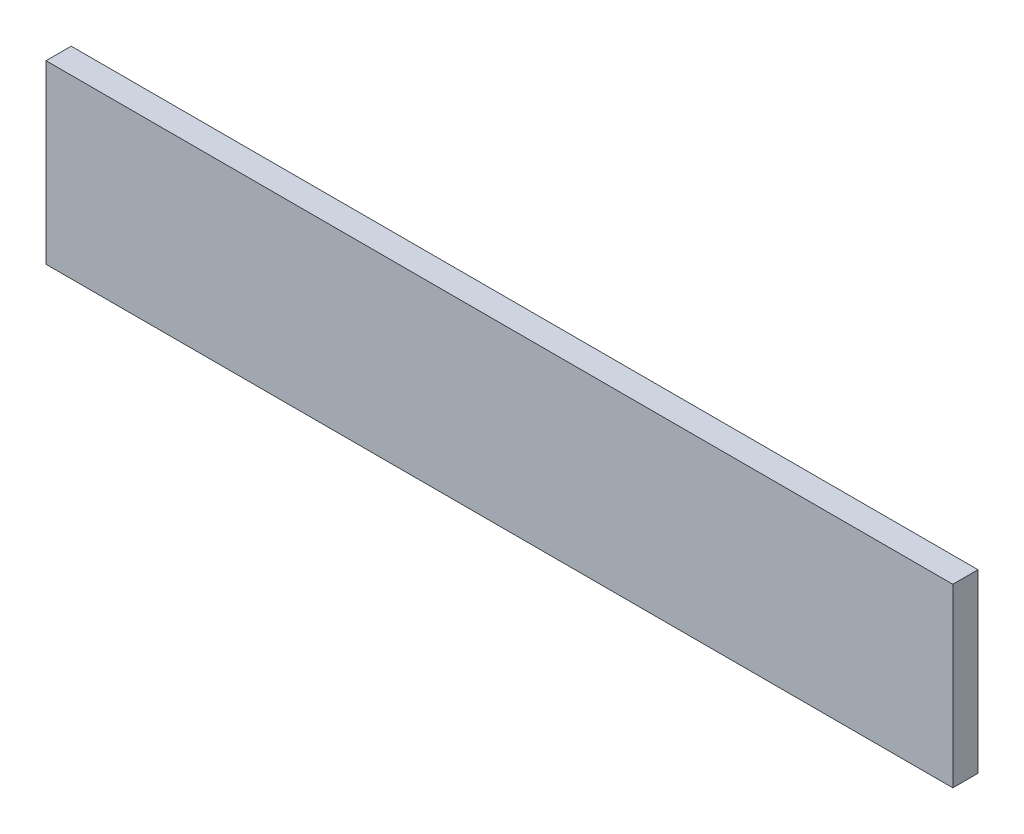
ISO-10303-21;
HEADER;
FILE_DESCRIPTION(('STEP AP214'),'2;1');
FILE_NAME('part.step','',(''),(''),'','','');
FILE_SCHEMA(('AUTOMOTIVE_DESIGN { 1 0 10303 214 1 1 1 1 }'));
ENDSEC;
DATA;
#1=APPLICATION_CONTEXT('core data for automotive mechanical design processes');
#2=APPLICATION_PROTOCOL_DEFINITION('international standard','automotive_design',2000,#1);
#3=PRODUCT_CONTEXT('',#1,'mechanical');
#4=PRODUCT('Part','Part','',(#3));
#5=PRODUCT_RELATED_PRODUCT_CATEGORY('part','',(#4));
#6=PRODUCT_DEFINITION_FORMATION('','',#4);
#7=PRODUCT_DEFINITION_CONTEXT('part definition',#1,'design');
#8=PRODUCT_DEFINITION('design','',#6,#7);
#9=PRODUCT_DEFINITION_SHAPE('','',#8);
#10=(LENGTH_UNIT() NAMED_UNIT(*) SI_UNIT(.MILLI.,.METRE.));
#11=(NAMED_UNIT(*) PLANE_ANGLE_UNIT() SI_UNIT($,.RADIAN.));
#12=(NAMED_UNIT(*) SI_UNIT($,.STERADIAN.) SOLID_ANGLE_UNIT());
#13=UNCERTAINTY_MEASURE_WITH_UNIT(LENGTH_MEASURE(1.E-05),#10,'distance_accuracy_value','');
#14=(GEOMETRIC_REPRESENTATION_CONTEXT(3) GLOBAL_UNCERTAINTY_ASSIGNED_CONTEXT((#13)) GLOBAL_UNIT_ASSIGNED_CONTEXT((#10,
#11,#12)) REPRESENTATION_CONTEXT('',''));
#15=CARTESIAN_POINT('',(0.,0.,0.));
#16=DIRECTION('',(0.,0.,1.));
#17=DIRECTION('',(1.,0.,0.));
#18=AXIS2_PLACEMENT_3D('',#15,#16,#17);
#19=CARTESIAN_POINT('',(0.,0.,5.));
#20=DIRECTION('',(1.,0.,0.));
#21=DIRECTION('',(0.,0.,-0.999999999999995));
#22=AXIS2_PLACEMENT_3D('',#19,#20,#21);
#23=PLANE('',#22);
#24=DIRECTION('',(0.,-1.,0.));
#25=VECTOR('',#24,1.);
#26=CARTESIAN_POINT('',(0.,0.,0.));
#27=LINE('',#26,#25);
#28=CARTESIAN_POINT('',(0.,35.,0.));
#29=VERTEX_POINT('',#28);
#30=CARTESIAN_POINT('',(0.,0.,0.));
#31=VERTEX_POINT('',#30);
#32=EDGE_CURVE('E96',#29,#31,#27,.T.);
#33=ORIENTED_EDGE('',*,*,#32,.T.);
#34=DIRECTION('',(0.,0.,-0.999999999999995));
#35=VECTOR('',#34,1.);
#36=CARTESIAN_POINT('',(0.,0.,5.));
#37=LINE('',#36,#35);
#38=CARTESIAN_POINT('',(0.,0.,5.));
#39=VERTEX_POINT('',#38);
#40=EDGE_CURVE('E11',#39,#31,#37,.T.);
#41=ORIENTED_EDGE('',*,*,#40,.F.);
#42=DIRECTION('',(0.,-1.,0.));
#43=VECTOR('',#42,1.);
#44=CARTESIAN_POINT('',(0.,0.,5.));
#45=LINE('',#44,#43);
#46=CARTESIAN_POINT('',(0.,35.,5.));
#47=VERTEX_POINT('',#46);
#48=EDGE_CURVE('E84',#47,#39,#45,.T.);
#49=ORIENTED_EDGE('',*,*,#48,.F.);
#50=DIRECTION('',(0.,0.,-0.999999999999995));
#51=VECTOR('',#50,1.);
#52=CARTESIAN_POINT('',(0.,35.,5.));
#53=LINE('',#52,#51);
#54=EDGE_CURVE('E92',#47,#29,#53,.T.);
#55=ORIENTED_EDGE('',*,*,#54,.T.);
#56=EDGE_LOOP('',(#33,#41,#49,#55));
#57=FACE_BOUND('',#56,.T.);
#58=ADVANCED_FACE('F33',(#57),#23,.F.);
#59=CARTESIAN_POINT('',(0.,0.,5.));
#60=DIRECTION('',(0.,1.,0.));
#61=DIRECTION('',(0.,0.,0.999999999999995));
#62=AXIS2_PLACEMENT_3D('',#59,#60,#61);
#63=PLANE('',#62);
#64=DIRECTION('',(1.,0.,0.));
#65=VECTOR('',#64,1.);
#66=CARTESIAN_POINT('',(0.,0.,0.));
#67=LINE('',#66,#65);
#68=CARTESIAN_POINT('',(180.,0.,0.));
#69=VERTEX_POINT('',#68);
#70=EDGE_CURVE('E88',#31,#69,#67,.T.);
#71=ORIENTED_EDGE('',*,*,#70,.T.);
#72=DIRECTION('',(0.,0.,-0.999999999999995));
#73=VECTOR('',#72,1.);
#74=CARTESIAN_POINT('',(180.,0.,5.));
#75=LINE('',#74,#73);
#76=CARTESIAN_POINT('',(180.,0.,5.));
#77=VERTEX_POINT('',#76);
#78=EDGE_CURVE('E41',#77,#69,#75,.T.);
#79=ORIENTED_EDGE('',*,*,#78,.F.);
#80=DIRECTION('',(1.,0.,0.));
#81=VECTOR('',#80,1.);
#82=CARTESIAN_POINT('',(0.,0.,5.));
#83=LINE('',#82,#81);
#84=EDGE_CURVE('E79',#39,#77,#83,.T.);
#85=ORIENTED_EDGE('',*,*,#84,.F.);
#86=ORIENTED_EDGE('',*,*,#40,.T.);
#87=EDGE_LOOP('',(#71,#79,#85,#86));
#88=FACE_BOUND('',#87,.T.);
#89=ADVANCED_FACE('F87',(#88),#63,.F.);
#90=CARTESIAN_POINT('',(180.,0.,5.));
#91=DIRECTION('',(-1.,0.,0.));
#92=DIRECTION('',(0.,0.,0.999999999999995));
#93=AXIS2_PLACEMENT_3D('',#90,#91,#92);
#94=PLANE('',#93);
#95=DIRECTION('',(0.,1.,0.));
#96=VECTOR('',#95,1.);
#97=CARTESIAN_POINT('',(180.,0.,0.));
#98=LINE('',#97,#96);
#99=CARTESIAN_POINT('',(180.,35.,0.));
#100=VERTEX_POINT('',#99);
#101=EDGE_CURVE('E66',#69,#100,#98,.T.);
#102=ORIENTED_EDGE('',*,*,#101,.T.);
#103=DIRECTION('',(0.,0.,-0.999999999999995));
#104=VECTOR('',#103,1.);
#105=CARTESIAN_POINT('',(180.,35.,5.));
#106=LINE('',#105,#104);
#107=CARTESIAN_POINT('',(180.,35.,5.));
#108=VERTEX_POINT('',#107);
#109=EDGE_CURVE('E89',#108,#100,#106,.T.);
#110=ORIENTED_EDGE('',*,*,#109,.F.);
#111=DIRECTION('',(0.,1.,0.));
#112=VECTOR('',#111,1.);
#113=CARTESIAN_POINT('',(180.,0.,5.));
#114=LINE('',#113,#112);
#115=EDGE_CURVE('E82',#77,#108,#114,.T.);
#116=ORIENTED_EDGE('',*,*,#115,.F.);
#117=ORIENTED_EDGE('',*,*,#78,.T.);
#118=EDGE_LOOP('',(#102,#110,#116,#117));
#119=FACE_BOUND('',#118,.T.);
#120=ADVANCED_FACE('F90',(#119),#94,.F.);
#121=CARTESIAN_POINT('',(0.,35.,5.));
#122=DIRECTION('',(0.,-1.,0.));
#123=DIRECTION('',(0.,0.,-0.999999999999995));
#124=AXIS2_PLACEMENT_3D('',#121,#122,#123);
#125=PLANE('',#124);
#126=DIRECTION('',(-1.,0.,0.));
#127=VECTOR('',#126,1.);
#128=CARTESIAN_POINT('',(0.,35.,0.));
#129=LINE('',#128,#127);
#130=EDGE_CURVE('E72',#100,#29,#129,.T.);
#131=ORIENTED_EDGE('',*,*,#130,.T.);
#132=ORIENTED_EDGE('',*,*,#54,.F.);
#133=DIRECTION('',(-1.,0.,0.));
#134=VECTOR('',#133,1.);
#135=CARTESIAN_POINT('',(0.,35.,5.));
#136=LINE('',#135,#134);
#137=EDGE_CURVE('E49',#108,#47,#136,.T.);
#138=ORIENTED_EDGE('',*,*,#137,.F.);
#139=ORIENTED_EDGE('',*,*,#109,.T.);
#140=EDGE_LOOP('',(#131,#132,#138,#139));
#141=FACE_BOUND('',#140,.T.);
#142=ADVANCED_FACE('F103',(#141),#125,.F.);
#143=CARTESIAN_POINT('',(0.,0.,5.));
#144=DIRECTION('',(0.,0.,-0.999999999999995));
#145=DIRECTION('',(-1.,0.,0.));
#146=AXIS2_PLACEMENT_3D('',#143,#144,#145);
#147=PLANE('',#146);
#148=ORIENTED_EDGE('',*,*,#48,.T.);
#149=ORIENTED_EDGE('',*,*,#84,.T.);
#150=ORIENTED_EDGE('',*,*,#115,.T.);
#151=ORIENTED_EDGE('',*,*,#137,.T.);
#152=EDGE_LOOP('',(#148,#149,#150,#151));
#153=FACE_BOUND('',#152,.T.);
#154=ADVANCED_FACE('F80',(#153),#147,.F.);
#155=CARTESIAN_POINT('',(0.,0.,0.));
#156=DIRECTION('',(0.,0.,-0.999999999999995));
#157=DIRECTION('',(-1.,0.,0.));
#158=AXIS2_PLACEMENT_3D('',#155,#156,#157);
#159=PLANE('',#158);
#160=ORIENTED_EDGE('',*,*,#32,.F.);
#161=ORIENTED_EDGE('',*,*,#130,.F.);
#162=ORIENTED_EDGE('',*,*,#101,.F.);
#163=ORIENTED_EDGE('',*,*,#70,.F.);
#164=EDGE_LOOP('',(#160,#161,#162,#163));
#165=FACE_BOUND('',#164,.T.);
#166=ADVANCED_FACE('F106',(#165),#159,.T.);
#167=CLOSED_SHELL('',(#58,#89,#120,#142,#154,#166));
#168=MANIFOLD_SOLID_BREP('B2',#167);
#169=ADVANCED_BREP_SHAPE_REPRESENTATION('',(#18,#168),#14);
#170=SHAPE_DEFINITION_REPRESENTATION(#9,#169);
ENDSEC;
END-ISO-10303-21;
